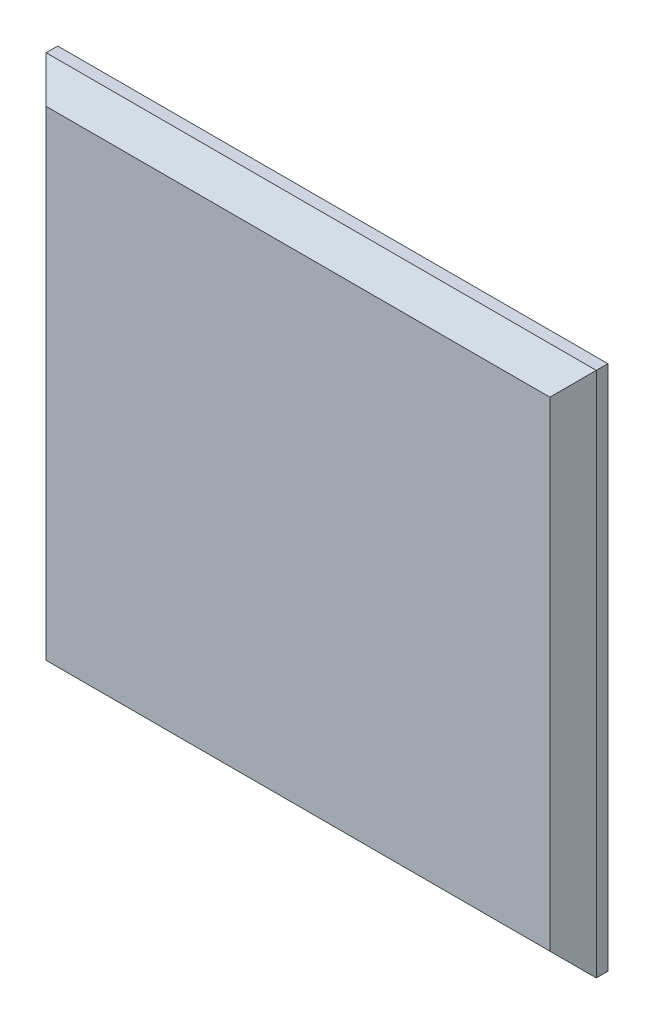
ISO-10303-21;
HEADER;
FILE_DESCRIPTION(('STEP AP214'),'2;1');
FILE_NAME('part.step','',(''),(''),'','','');
FILE_SCHEMA(('AUTOMOTIVE_DESIGN { 1 0 10303 214 1 1 1 1 }'));
ENDSEC;
DATA;
#1=APPLICATION_CONTEXT('core data for automotive mechanical design processes');
#2=APPLICATION_PROTOCOL_DEFINITION('international standard','automotive_design',2000,#1);
#3=PRODUCT_CONTEXT('',#1,'mechanical');
#4=PRODUCT('Part','Part','',(#3));
#5=PRODUCT_RELATED_PRODUCT_CATEGORY('part','',(#4));
#6=PRODUCT_DEFINITION_FORMATION('','',#4);
#7=PRODUCT_DEFINITION_CONTEXT('part definition',#1,'design');
#8=PRODUCT_DEFINITION('design','',#6,#7);
#9=PRODUCT_DEFINITION_SHAPE('','',#8);
#10=(LENGTH_UNIT() NAMED_UNIT(*) SI_UNIT(.MILLI.,.METRE.));
#11=(NAMED_UNIT(*) PLANE_ANGLE_UNIT() SI_UNIT($,.RADIAN.));
#12=(NAMED_UNIT(*) SI_UNIT($,.STERADIAN.) SOLID_ANGLE_UNIT());
#13=UNCERTAINTY_MEASURE_WITH_UNIT(LENGTH_MEASURE(1.E-05),#10,'distance_accuracy_value','');
#14=(GEOMETRIC_REPRESENTATION_CONTEXT(3) GLOBAL_UNCERTAINTY_ASSIGNED_CONTEXT((#13)) GLOBAL_UNIT_ASSIGNED_CONTEXT((#10,
#11,#12)) REPRESENTATION_CONTEXT('',''));
#15=CARTESIAN_POINT('',(0.,0.,0.));
#16=DIRECTION('',(0.,0.,1.));
#17=DIRECTION('',(1.,0.,0.));
#18=AXIS2_PLACEMENT_3D('',#15,#16,#17);
#19=CARTESIAN_POINT('',(0.,136.,6.));
#20=DIRECTION('',(0.,-1.,0.));
#21=DIRECTION('',(1.,0.,0.));
#22=AXIS2_PLACEMENT_3D('',#19,#20,#21);
#23=PLANE('',#22);
#24=DIRECTION('',(0.,0.,-1.));
#25=VECTOR('',#24,1.);
#26=CARTESIAN_POINT('',(-142.200000000008,136.,6.));
#27=LINE('',#26,#25);
#28=CARTESIAN_POINT('',(-142.200000000008,136.,2.99999999999999));
#29=VERTEX_POINT('',#28);
#30=CARTESIAN_POINT('',(-142.200000000008,136.,0.));
#31=VERTEX_POINT('',#30);
#32=EDGE_CURVE('E283',#29,#31,#27,.T.);
#33=ORIENTED_EDGE('',*,*,#32,.F.);
#34=DIRECTION('',(1.,0.,0.));
#35=VECTOR('',#34,1.);
#36=CARTESIAN_POINT('',(0.,136.,3.));
#37=LINE('',#36,#35);
#38=CARTESIAN_POINT('',(0.,136.,2.99999999999999));
#39=VERTEX_POINT('',#38);
#40=EDGE_CURVE('E318',#29,#39,#37,.T.);
#41=ORIENTED_EDGE('',*,*,#40,.T.);
#42=DIRECTION('',(0.,0.,-1.));
#43=VECTOR('',#42,1.);
#44=CARTESIAN_POINT('',(0.,136.,6.));
#45=LINE('',#44,#43);
#46=CARTESIAN_POINT('',(0.,136.,0.));
#47=VERTEX_POINT('',#46);
#48=EDGE_CURVE('E208',#39,#47,#45,.T.);
#49=ORIENTED_EDGE('',*,*,#48,.T.);
#50=DIRECTION('',(-1.,0.,0.));
#51=VECTOR('',#50,1.);
#52=CARTESIAN_POINT('',(0.,136.,0.));
#53=LINE('',#52,#51);
#54=EDGE_CURVE('E266',#47,#31,#53,.T.);
#55=ORIENTED_EDGE('',*,*,#54,.T.);
#56=EDGE_LOOP('',(#33,#41,#49,#55));
#57=FACE_BOUND('',#56,.T.);
#58=ADVANCED_FACE('F35',(#57),#23,.F.);
#59=CARTESIAN_POINT('',(-142.200000000008,0.,6.));
#60=DIRECTION('',(1.,0.,0.));
#61=DIRECTION('',(0.,0.,-1.));
#62=AXIS2_PLACEMENT_3D('',#59,#60,#61);
#63=PLANE('',#62);
#64=DIRECTION('',(0.,0.,-1.));
#65=VECTOR('',#64,1.);
#66=CARTESIAN_POINT('',(-142.200000000008,0.,6.));
#67=LINE('',#66,#65);
#68=CARTESIAN_POINT('',(-142.200000000008,0.,2.99999999999999));
#69=VERTEX_POINT('',#68);
#70=CARTESIAN_POINT('',(-142.200000000008,0.,0.));
#71=VERTEX_POINT('',#70);
#72=EDGE_CURVE('E281',#69,#71,#67,.T.);
#73=ORIENTED_EDGE('',*,*,#72,.F.);
#74=DIRECTION('',(0.,1.,0.));
#75=VECTOR('',#74,1.);
#76=CARTESIAN_POINT('',(-142.200000000008,136.,2.99999999999999));
#77=LINE('',#76,#75);
#78=EDGE_CURVE('E325',#69,#29,#77,.T.);
#79=ORIENTED_EDGE('',*,*,#78,.T.);
#80=ORIENTED_EDGE('',*,*,#32,.T.);
#81=DIRECTION('',(0.,-1.,0.));
#82=VECTOR('',#81,1.);
#83=CARTESIAN_POINT('',(-142.200000000008,0.,0.));
#84=LINE('',#83,#82);
#85=EDGE_CURVE('E269',#31,#71,#84,.T.);
#86=ORIENTED_EDGE('',*,*,#85,.T.);
#87=EDGE_LOOP('',(#73,#79,#80,#86));
#88=FACE_BOUND('',#87,.T.);
#89=ADVANCED_FACE('F441',(#88),#63,.F.);
#90=CARTESIAN_POINT('',(0.,0.,6.));
#91=DIRECTION('',(0.,1.,0.));
#92=DIRECTION('',(-1.,0.,0.));
#93=AXIS2_PLACEMENT_3D('',#90,#91,#92);
#94=PLANE('',#93);
#95=DIRECTION('',(0.,0.,-1.));
#96=VECTOR('',#95,1.);
#97=CARTESIAN_POINT('',(0.,0.,6.));
#98=LINE('',#97,#96);
#99=CARTESIAN_POINT('',(0.,0.,3.));
#100=VERTEX_POINT('',#99);
#101=CARTESIAN_POINT('',(0.,0.,0.));
#102=VERTEX_POINT('',#101);
#103=EDGE_CURVE('E279',#100,#102,#98,.T.);
#104=ORIENTED_EDGE('',*,*,#103,.F.);
#105=DIRECTION('',(-1.,0.,0.));
#106=VECTOR('',#105,1.);
#107=CARTESIAN_POINT('',(-142.200000000008,0.,3.));
#108=LINE('',#107,#106);
#109=EDGE_CURVE('E323',#100,#69,#108,.T.);
#110=ORIENTED_EDGE('',*,*,#109,.T.);
#111=ORIENTED_EDGE('',*,*,#72,.T.);
#112=DIRECTION('',(1.,0.,0.));
#113=VECTOR('',#112,1.);
#114=CARTESIAN_POINT('',(0.,0.,0.));
#115=LINE('',#114,#113);
#116=EDGE_CURVE('E272',#71,#102,#115,.T.);
#117=ORIENTED_EDGE('',*,*,#116,.T.);
#118=EDGE_LOOP('',(#104,#110,#111,#117));
#119=FACE_BOUND('',#118,.T.);
#120=ADVANCED_FACE('F447',(#119),#94,.F.);
#121=CARTESIAN_POINT('',(0.,126.5,6.));
#122=DIRECTION('',(0.,-1.,0.));
#123=DIRECTION('',(0.,0.,-1.));
#124=AXIS2_PLACEMENT_3D('',#121,#122,#123);
#125=PLANE('',#124);
#126=DIRECTION('',(0.,0.,-1.));
#127=VECTOR('',#126,1.);
#128=CARTESIAN_POINT('',(-135.700000000008,126.5,6.));
#129=LINE('',#128,#127);
#130=CARTESIAN_POINT('',(-135.700000000008,126.5,3.49999999999999));
#131=VERTEX_POINT('',#130);
#132=CARTESIAN_POINT('',(-135.700000000008,126.5,0.));
#133=VERTEX_POINT('',#132);
#134=EDGE_CURVE('E197',#131,#133,#129,.T.);
#135=ORIENTED_EDGE('',*,*,#134,.F.);
#136=DIRECTION('',(0.707106781186555,0.,0.70710678118654));
#137=VECTOR('',#136,1.);
#138=CARTESIAN_POINT('',(-66.6000000000025,126.5,72.6000000000038));
#139=LINE('',#138,#137);
#140=CARTESIAN_POINT('',(-137.200000000008,126.5,2.00000000000002));
#141=VERTEX_POINT('',#140);
#142=EDGE_CURVE('E362',#131,#141,#139,.F.);
#143=ORIENTED_EDGE('',*,*,#142,.T.);
#144=DIRECTION('',(0.,0.,-1.));
#145=VECTOR('',#144,1.);
#146=CARTESIAN_POINT('',(-137.200000000008,126.5,6.));
#147=LINE('',#146,#145);
#148=CARTESIAN_POINT('',(-137.200000000008,126.5,0.));
#149=VERTEX_POINT('',#148);
#150=EDGE_CURVE('E223',#141,#149,#147,.T.);
#151=ORIENTED_EDGE('',*,*,#150,.T.);
#152=DIRECTION('',(-1.,0.,0.));
#153=VECTOR('',#152,1.);
#154=CARTESIAN_POINT('',(0.,126.5,0.));
#155=LINE('',#154,#153);
#156=EDGE_CURVE('E216',#133,#149,#155,.T.);
#157=ORIENTED_EDGE('',*,*,#156,.F.);
#158=EDGE_LOOP('',(#135,#143,#151,#157));
#159=FACE_BOUND('',#158,.T.);
#160=ADVANCED_FACE('F221',(#159),#125,.T.);
#161=CARTESIAN_POINT('',(-135.700000000008,129.5,6.));
#162=DIRECTION('',(0.,0.,-1.));
#163=DIRECTION('',(-1.,0.,0.));
#164=AXIS2_PLACEMENT_3D('',#161,#162,#163);
#165=CYLINDRICAL_SURFACE('',#164,3.00000000000002);
#166=DIRECTION('',(0.,0.,-1.));
#167=VECTOR('',#166,1.);
#168=CARTESIAN_POINT('',(-132.700000000008,129.5,6.));
#169=LINE('',#168,#167);
#170=CARTESIAN_POINT('',(-132.700000000008,129.5,3.49999999999996));
#171=VERTEX_POINT('',#170);
#172=CARTESIAN_POINT('',(-132.700000000008,129.5,0.));
#173=VERTEX_POINT('',#172);
#174=EDGE_CURVE('E209',#171,#173,#169,.T.);
#175=ORIENTED_EDGE('',*,*,#174,.F.);
#176=CARTESIAN_POINT('',(-135.700000000008,129.5,3.49999999999996));
#177=DIRECTION('',(0.,0.707106781186552,0.707106781186542));
#178=DIRECTION('',(0.,0.707106781186543,-0.707106781186552));
#179=AXIS2_PLACEMENT_3D('',#176,#177,#178);
#180=ELLIPSE('',#179,4.24264068711935,3.00000000000002);
#181=CARTESIAN_POINT('',(-133.578679656448,127.37867965644,5.62132034355967));
#182=VERTEX_POINT('',#181);
#183=EDGE_CURVE('E339',#171,#182,#180,.F.);
#184=ORIENTED_EDGE('',*,*,#183,.T.);
#185=CARTESIAN_POINT('',(-135.700000000008,129.5,3.50000000000001));
#186=DIRECTION('',(0.70710678118654,0.,-0.707106781186555));
#187=DIRECTION('',(-0.707106781186555,0.,-0.70710678118654));
#188=AXIS2_PLACEMENT_3D('',#185,#186,#187);
#189=ELLIPSE('',#188,4.24264068711927,3.00000000000002);
#190=EDGE_CURVE('E204',#182,#131,#189,.T.);
#191=ORIENTED_EDGE('',*,*,#190,.T.);
#192=ORIENTED_EDGE('',*,*,#134,.T.);
#193=CARTESIAN_POINT('',(-135.700000000008,129.5,0.));
#194=DIRECTION('',(0.,0.,1.));
#195=DIRECTION('',(1.,0.,0.));
#196=AXIS2_PLACEMENT_3D('',#193,#194,#195);
#197=CIRCLE('',#196,3.00000000000002);
#198=EDGE_CURVE('E201',#133,#173,#197,.T.);
#199=ORIENTED_EDGE('',*,*,#198,.T.);
#200=EDGE_LOOP('',(#175,#184,#191,#192,#199));
#201=FACE_BOUND('',#200,.T.);
#202=ADVANCED_FACE('F200',(#201),#165,.T.);
#203=CARTESIAN_POINT('',(-132.700000000008,0.,6.));
#204=DIRECTION('',(-1.,0.,0.));
#205=DIRECTION('',(0.,0.,1.));
#206=AXIS2_PLACEMENT_3D('',#203,#204,#205);
#207=PLANE('',#206);
#208=DIRECTION('',(0.,0.,-1.));
#209=VECTOR('',#208,1.);
#210=CARTESIAN_POINT('',(-132.700000000008,131.,6.));
#211=LINE('',#210,#209);
#212=CARTESIAN_POINT('',(-132.700000000008,131.,1.99999999999993));
#213=VERTEX_POINT('',#212);
#214=CARTESIAN_POINT('',(-132.700000000008,131.,0.));
#215=VERTEX_POINT('',#214);
#216=EDGE_CURVE('E307',#213,#215,#211,.T.);
#217=ORIENTED_EDGE('',*,*,#216,.F.);
#218=DIRECTION('',(0.,-0.707106781186543,0.707106781186552));
#219=VECTOR('',#218,1.);
#220=CARTESIAN_POINT('',(-132.700000000008,131.,1.99999999999993));
#221=LINE('',#220,#219);
#222=EDGE_CURVE('E336',#213,#171,#221,.T.);
#223=ORIENTED_EDGE('',*,*,#222,.T.);
#224=ORIENTED_EDGE('',*,*,#174,.T.);
#225=DIRECTION('',(0.,1.,0.));
#226=VECTOR('',#225,1.);
#227=CARTESIAN_POINT('',(-132.700000000008,0.,0.));
#228=LINE('',#227,#226);
#229=EDGE_CURVE('E219',#173,#215,#228,.T.);
#230=ORIENTED_EDGE('',*,*,#229,.T.);
#231=EDGE_LOOP('',(#217,#223,#224,#230));
#232=FACE_BOUND('',#231,.T.);
#233=ADVANCED_FACE('F744',(#232),#207,.F.);
#234=CARTESIAN_POINT('',(0.,131.,6.));
#235=DIRECTION('',(0.,-1.,0.));
#236=DIRECTION('',(1.,0.,0.));
#237=AXIS2_PLACEMENT_3D('',#234,#235,#236);
#238=PLANE('',#237);
#239=DIRECTION('',(0.,0.,-1.));
#240=VECTOR('',#239,1.);
#241=CARTESIAN_POINT('',(-7.9999999999982,131.,6.));
#242=LINE('',#241,#240);
#243=CARTESIAN_POINT('',(-7.9999999999982,131.,1.99999999999994));
#244=VERTEX_POINT('',#243);
#245=CARTESIAN_POINT('',(-7.9999999999982,131.,0.));
#246=VERTEX_POINT('',#245);
#247=EDGE_CURVE('E305',#244,#246,#242,.T.);
#248=ORIENTED_EDGE('',*,*,#247,.F.);
#249=DIRECTION('',(-1.,0.,0.));
#250=VECTOR('',#249,1.);
#251=CARTESIAN_POINT('',(0.,131.,1.99999999999994));
#252=LINE('',#251,#250);
#253=EDGE_CURVE('E327',#244,#213,#252,.T.);
#254=ORIENTED_EDGE('',*,*,#253,.T.);
#255=ORIENTED_EDGE('',*,*,#216,.T.);
#256=DIRECTION('',(-1.,0.,0.));
#257=VECTOR('',#256,1.);
#258=CARTESIAN_POINT('',(0.,131.,0.));
#259=LINE('',#258,#257);
#260=EDGE_CURVE('E235',#246,#215,#259,.T.);
#261=ORIENTED_EDGE('',*,*,#260,.F.);
#262=EDGE_LOOP('',(#248,#254,#255,#261));
#263=FACE_BOUND('',#262,.T.);
#264=ADVANCED_FACE('F751',(#263),#238,.T.);
#265=CARTESIAN_POINT('',(-7.9999999999982,0.,6.));
#266=DIRECTION('',(-1.,0.,0.));
#267=DIRECTION('',(0.,0.,1.));
#268=AXIS2_PLACEMENT_3D('',#265,#266,#267);
#269=PLANE('',#268);
#270=DIRECTION('',(0.,0.,-1.));
#271=VECTOR('',#270,1.);
#272=CARTESIAN_POINT('',(-7.9999999999982,129.5,6.));
#273=LINE('',#272,#271);
#274=CARTESIAN_POINT('',(-7.9999999999982,129.5,3.49999999999997));
#275=VERTEX_POINT('',#274);
#276=CARTESIAN_POINT('',(-7.9999999999982,129.5,0.));
#277=VERTEX_POINT('',#276);
#278=EDGE_CURVE('E303',#275,#277,#273,.T.);
#279=ORIENTED_EDGE('',*,*,#278,.F.);
#280=DIRECTION('',(0.,0.707106781186543,-0.707106781186552));
#281=VECTOR('',#280,1.);
#282=CARTESIAN_POINT('',(-7.9999999999982,63.5000000000009,69.5));
#283=LINE('',#282,#281);
#284=EDGE_CURVE('E354',#275,#244,#283,.T.);
#285=ORIENTED_EDGE('',*,*,#284,.T.);
#286=ORIENTED_EDGE('',*,*,#247,.T.);
#287=DIRECTION('',(0.,1.,0.));
#288=VECTOR('',#287,1.);
#289=CARTESIAN_POINT('',(-7.9999999999982,0.,0.));
#290=LINE('',#289,#288);
#291=EDGE_CURVE('E237',#277,#246,#290,.T.);
#292=ORIENTED_EDGE('',*,*,#291,.F.);
#293=EDGE_LOOP('',(#279,#285,#286,#292));
#294=FACE_BOUND('',#293,.T.);
#295=ADVANCED_FACE('F759',(#294),#269,.T.);
#296=CARTESIAN_POINT('',(-4.9999999999982,129.5,6.));
#297=DIRECTION('',(0.,0.,-1.));
#298=DIRECTION('',(-1.,0.,0.));
#299=AXIS2_PLACEMENT_3D('',#296,#297,#298);
#300=CYLINDRICAL_SURFACE('',#299,3.);
#301=CARTESIAN_POINT('',(-4.9999999999982,129.5,1.99999999999994));
#302=DIRECTION('',(0.707106781186552,0.,0.707106781186542));
#303=DIRECTION('',(0.707106781186543,0.,-0.707106781186552));
#304=AXIS2_PLACEMENT_3D('',#301,#302,#303);
#305=ELLIPSE('',#304,4.24264068711932,3.);
#306=CARTESIAN_POINT('',(-4.9999999999982,126.5,1.99999999999994));
#307=VERTEX_POINT('',#306);
#308=CARTESIAN_POINT('',(-7.73431348329664,128.265686516702,4.73431348329842));
#309=VERTEX_POINT('',#308);
#310=EDGE_CURVE('E350',#307,#309,#305,.F.);
#311=ORIENTED_EDGE('',*,*,#310,.T.);
#312=CARTESIAN_POINT('',(-4.9999999999982,129.5,3.49999999999996));
#313=DIRECTION('',(0.,0.707106781186552,0.707106781186542));
#314=DIRECTION('',(0.,0.707106781186543,-0.707106781186552));
#315=AXIS2_PLACEMENT_3D('',#312,#313,#314);
#316=ELLIPSE('',#315,4.24264068711932,3.);
#317=EDGE_CURVE('E352',#309,#275,#316,.F.);
#318=ORIENTED_EDGE('',*,*,#317,.T.);
#319=ORIENTED_EDGE('',*,*,#278,.T.);
#320=CARTESIAN_POINT('',(-4.9999999999982,129.5,0.));
#321=DIRECTION('',(0.,0.,1.));
#322=DIRECTION('',(1.,0.,0.));
#323=AXIS2_PLACEMENT_3D('',#320,#321,#322);
#324=CIRCLE('',#323,3.);
#325=CARTESIAN_POINT('',(-4.9999999999982,126.5,0.));
#326=VERTEX_POINT('',#325);
#327=EDGE_CURVE('E240',#277,#326,#324,.T.);
#328=ORIENTED_EDGE('',*,*,#327,.T.);
#329=DIRECTION('',(0.,0.,-1.));
#330=VECTOR('',#329,1.);
#331=CARTESIAN_POINT('',(-4.9999999999982,126.5,6.));
#332=LINE('',#331,#330);
#333=EDGE_CURVE('E301',#307,#326,#332,.T.);
#334=ORIENTED_EDGE('',*,*,#333,.F.);
#335=EDGE_LOOP('',(#311,#318,#319,#328,#334));
#336=FACE_BOUND('',#335,.T.);
#337=ADVANCED_FACE('F767',(#336),#300,.T.);
#338=CARTESIAN_POINT('',(-4.9999999999982,0.,6.));
#339=DIRECTION('',(-1.,0.,0.));
#340=DIRECTION('',(0.,0.,1.));
#341=AXIS2_PLACEMENT_3D('',#338,#339,#340);
#342=PLANE('',#341);
#343=DIRECTION('',(0.,0.,-1.));
#344=VECTOR('',#343,1.);
#345=CARTESIAN_POINT('',(-4.9999999999982,9.5,6.));
#346=LINE('',#345,#344);
#347=CARTESIAN_POINT('',(-4.9999999999982,9.5,1.99999999999994));
#348=VERTEX_POINT('',#347);
#349=CARTESIAN_POINT('',(-4.9999999999982,9.5,0.));
#350=VERTEX_POINT('',#349);
#351=EDGE_CURVE('E299',#348,#350,#346,.T.);
#352=ORIENTED_EDGE('',*,*,#351,.F.);
#353=DIRECTION('',(0.,1.,0.));
#354=VECTOR('',#353,1.);
#355=CARTESIAN_POINT('',(-4.9999999999982,0.,1.99999999999994));
#356=LINE('',#355,#354);
#357=EDGE_CURVE('E356',#348,#307,#356,.T.);
#358=ORIENTED_EDGE('',*,*,#357,.T.);
#359=ORIENTED_EDGE('',*,*,#333,.T.);
#360=DIRECTION('',(0.,1.,0.));
#361=VECTOR('',#360,1.);
#362=CARTESIAN_POINT('',(-4.9999999999982,0.,0.));
#363=LINE('',#362,#361);
#364=EDGE_CURVE('E243',#350,#326,#363,.T.);
#365=ORIENTED_EDGE('',*,*,#364,.F.);
#366=EDGE_LOOP('',(#352,#358,#359,#365));
#367=FACE_BOUND('',#366,.T.);
#368=ADVANCED_FACE('F775',(#367),#342,.T.);
#369=CARTESIAN_POINT('',(-4.9999999999982,6.5,6.));
#370=DIRECTION('',(0.,0.,-1.));
#371=DIRECTION('',(-1.,0.,0.));
#372=AXIS2_PLACEMENT_3D('',#369,#370,#371);
#373=CYLINDRICAL_SURFACE('',#372,3.);
#374=CARTESIAN_POINT('',(-4.9999999999982,6.5,3.49999999999996));
#375=DIRECTION('',(0.,-0.707106781186552,0.707106781186543));
#376=DIRECTION('',(0.,-0.707106781186543,-0.707106781186552));
#377=AXIS2_PLACEMENT_3D('',#374,#375,#376);
#378=ELLIPSE('',#377,4.24264068711931,3.);
#379=CARTESIAN_POINT('',(-7.9999999999982,6.5,3.49999999999996));
#380=VERTEX_POINT('',#379);
#381=CARTESIAN_POINT('',(-7.73431348329664,7.73431348329844,4.73431348329842));
#382=VERTEX_POINT('',#381);
#383=EDGE_CURVE('E358',#380,#382,#378,.F.);
#384=ORIENTED_EDGE('',*,*,#383,.T.);
#385=CARTESIAN_POINT('',(-4.9999999999982,6.5,1.99999999999994));
#386=DIRECTION('',(0.707106781186552,0.,0.707106781186542));
#387=DIRECTION('',(0.707106781186543,0.,-0.707106781186552));
#388=AXIS2_PLACEMENT_3D('',#385,#386,#387);
#389=ELLIPSE('',#388,4.24264068711931,3.);
#390=EDGE_CURVE('E360',#382,#348,#389,.F.);
#391=ORIENTED_EDGE('',*,*,#390,.T.);
#392=ORIENTED_EDGE('',*,*,#351,.T.);
#393=CARTESIAN_POINT('',(-4.9999999999982,6.5,0.));
#394=DIRECTION('',(0.,0.,1.));
#395=DIRECTION('',(1.,0.,0.));
#396=AXIS2_PLACEMENT_3D('',#393,#394,#395);
#397=CIRCLE('',#396,3.);
#398=CARTESIAN_POINT('',(-7.9999999999982,6.5,0.));
#399=VERTEX_POINT('',#398);
#400=EDGE_CURVE('E246',#350,#399,#397,.T.);
#401=ORIENTED_EDGE('',*,*,#400,.T.);
#402=DIRECTION('',(0.,0.,-1.));
#403=VECTOR('',#402,1.);
#404=CARTESIAN_POINT('',(-7.9999999999982,6.5,6.));
#405=LINE('',#404,#403);
#406=EDGE_CURVE('E297',#380,#399,#405,.T.);
#407=ORIENTED_EDGE('',*,*,#406,.F.);
#408=EDGE_LOOP('',(#384,#391,#392,#401,#407));
#409=FACE_BOUND('',#408,.T.);
#410=ADVANCED_FACE('F425',(#409),#373,.T.);
#411=CARTESIAN_POINT('',(-7.9999999999982,0.,6.));
#412=DIRECTION('',(1.,0.,0.));
#413=DIRECTION('',(0.,0.,-1.));
#414=AXIS2_PLACEMENT_3D('',#411,#412,#413);
#415=PLANE('',#414);
#416=DIRECTION('',(0.,0.,-1.));
#417=VECTOR('',#416,1.);
#418=CARTESIAN_POINT('',(-7.9999999999982,5.,6.));
#419=LINE('',#418,#417);
#420=CARTESIAN_POINT('',(-7.9999999999982,5.,1.99999999999994));
#421=VERTEX_POINT('',#420);
#422=CARTESIAN_POINT('',(-7.9999999999982,5.,0.));
#423=VERTEX_POINT('',#422);
#424=EDGE_CURVE('E295',#421,#423,#419,.T.);
#425=ORIENTED_EDGE('',*,*,#424,.F.);
#426=DIRECTION('',(0.,0.707106781186543,0.707106781186552));
#427=VECTOR('',#426,1.);
#428=CARTESIAN_POINT('',(-7.9999999999982,5.,1.99999999999994));
#429=LINE('',#428,#427);
#430=EDGE_CURVE('E44',#421,#380,#429,.T.);
#431=ORIENTED_EDGE('',*,*,#430,.T.);
#432=ORIENTED_EDGE('',*,*,#406,.T.);
#433=DIRECTION('',(0.,-1.,0.));
#434=VECTOR('',#433,1.);
#435=CARTESIAN_POINT('',(-7.9999999999982,0.,0.));
#436=LINE('',#435,#434);
#437=EDGE_CURVE('E249',#399,#423,#436,.T.);
#438=ORIENTED_EDGE('',*,*,#437,.T.);
#439=EDGE_LOOP('',(#425,#431,#432,#438));
#440=FACE_BOUND('',#439,.T.);
#441=ADVANCED_FACE('F423',(#440),#415,.F.);
#442=CARTESIAN_POINT('',(0.,5.,6.));
#443=DIRECTION('',(0.,1.,0.));
#444=DIRECTION('',(0.,0.,1.));
#445=AXIS2_PLACEMENT_3D('',#442,#443,#444);
#446=PLANE('',#445);
#447=DIRECTION('',(0.,0.,-1.));
#448=VECTOR('',#447,1.);
#449=CARTESIAN_POINT('',(-132.700000000008,5.,6.));
#450=LINE('',#449,#448);
#451=CARTESIAN_POINT('',(-132.700000000008,5.,1.99999999999994));
#452=VERTEX_POINT('',#451);
#453=CARTESIAN_POINT('',(-132.700000000008,5.,0.));
#454=VERTEX_POINT('',#453);
#455=EDGE_CURVE('E293',#452,#454,#450,.T.);
#456=ORIENTED_EDGE('',*,*,#455,.F.);
#457=DIRECTION('',(1.,0.,0.));
#458=VECTOR('',#457,1.);
#459=CARTESIAN_POINT('',(0.,5.,1.99999999999994));
#460=LINE('',#459,#458);
#461=EDGE_CURVE('E52',#452,#421,#460,.T.);
#462=ORIENTED_EDGE('',*,*,#461,.T.);
#463=ORIENTED_EDGE('',*,*,#424,.T.);
#464=DIRECTION('',(1.,0.,0.));
#465=VECTOR('',#464,1.);
#466=CARTESIAN_POINT('',(0.,5.,0.));
#467=LINE('',#466,#465);
#468=EDGE_CURVE('E252',#454,#423,#467,.T.);
#469=ORIENTED_EDGE('',*,*,#468,.F.);
#470=EDGE_LOOP('',(#456,#462,#463,#469));
#471=FACE_BOUND('',#470,.T.);
#472=ADVANCED_FACE('F431',(#471),#446,.T.);
#473=CARTESIAN_POINT('',(-132.700000000008,0.,6.));
#474=DIRECTION('',(1.,0.,0.));
#475=DIRECTION('',(0.,0.,-1.));
#476=AXIS2_PLACEMENT_3D('',#473,#474,#475);
#477=PLANE('',#476);
#478=DIRECTION('',(0.,0.,-1.));
#479=VECTOR('',#478,1.);
#480=CARTESIAN_POINT('',(-132.700000000008,6.5,6.));
#481=LINE('',#480,#479);
#482=CARTESIAN_POINT('',(-132.700000000008,6.5,3.49999999999996));
#483=VERTEX_POINT('',#482);
#484=CARTESIAN_POINT('',(-132.700000000008,6.5,0.));
#485=VERTEX_POINT('',#484);
#486=EDGE_CURVE('E291',#483,#485,#481,.T.);
#487=ORIENTED_EDGE('',*,*,#486,.F.);
#488=DIRECTION('',(0.,-0.707106781186543,-0.707106781186552));
#489=VECTOR('',#488,1.);
#490=CARTESIAN_POINT('',(-132.700000000008,4.50000000000006,1.5));
#491=LINE('',#490,#489);
#492=EDGE_CURVE('E11',#483,#452,#491,.T.);
#493=ORIENTED_EDGE('',*,*,#492,.T.);
#494=ORIENTED_EDGE('',*,*,#455,.T.);
#495=DIRECTION('',(0.,-1.,0.));
#496=VECTOR('',#495,1.);
#497=CARTESIAN_POINT('',(-132.700000000008,0.,0.));
#498=LINE('',#497,#496);
#499=EDGE_CURVE('E255',#485,#454,#498,.T.);
#500=ORIENTED_EDGE('',*,*,#499,.F.);
#501=EDGE_LOOP('',(#487,#493,#494,#500));
#502=FACE_BOUND('',#501,.T.);
#503=ADVANCED_FACE('F420',(#502),#477,.T.);
#504=CARTESIAN_POINT('',(-135.700000000008,6.5,6.));
#505=DIRECTION('',(0.,0.,-1.));
#506=DIRECTION('',(-1.,0.,0.));
#507=AXIS2_PLACEMENT_3D('',#504,#505,#506);
#508=CYLINDRICAL_SURFACE('',#507,2.99999999999999);
#509=DIRECTION('',(0.,0.,-1.));
#510=VECTOR('',#509,1.);
#511=CARTESIAN_POINT('',(-135.700000000008,9.5,6.));
#512=LINE('',#511,#510);
#513=CARTESIAN_POINT('',(-135.700000000008,9.5,3.50000000000056));
#514=VERTEX_POINT('',#513);
#515=CARTESIAN_POINT('',(-135.700000000008,9.5,0.));
#516=VERTEX_POINT('',#515);
#517=EDGE_CURVE('E289',#514,#516,#512,.T.);
#518=ORIENTED_EDGE('',*,*,#517,.F.);
#519=CARTESIAN_POINT('',(-135.700000000008,6.5,3.50000000000057));
#520=DIRECTION('',(0.70710678118654,0.,-0.707106781186555));
#521=DIRECTION('',(-0.707106781186555,0.,-0.70710678118654));
#522=AXIS2_PLACEMENT_3D('',#519,#520,#521);
#523=ELLIPSE('',#522,4.24264068711923,2.99999999999999);
#524=CARTESIAN_POINT('',(-133.578679656448,8.62132034355989,5.62132034355988));
#525=VERTEX_POINT('',#524);
#526=EDGE_CURVE('E370',#514,#525,#523,.T.);
#527=ORIENTED_EDGE('',*,*,#526,.T.);
#528=CARTESIAN_POINT('',(-135.700000000008,6.5,3.49999999999996));
#529=DIRECTION('',(0.,-0.707106781186552,0.707106781186543));
#530=DIRECTION('',(0.,-0.707106781186543,-0.707106781186552));
#531=AXIS2_PLACEMENT_3D('',#528,#529,#530);
#532=ELLIPSE('',#531,4.24264068711931,2.99999999999999);
#533=EDGE_CURVE('E368',#525,#483,#532,.F.);
#534=ORIENTED_EDGE('',*,*,#533,.T.);
#535=ORIENTED_EDGE('',*,*,#486,.T.);
#536=CARTESIAN_POINT('',(-135.700000000008,6.5,0.));
#537=DIRECTION('',(0.,0.,1.));
#538=DIRECTION('',(1.,0.,0.));
#539=AXIS2_PLACEMENT_3D('',#536,#537,#538);
#540=CIRCLE('',#539,2.99999999999999);
#541=EDGE_CURVE('E258',#485,#516,#540,.T.);
#542=ORIENTED_EDGE('',*,*,#541,.T.);
#543=EDGE_LOOP('',(#518,#527,#534,#535,#542));
#544=FACE_BOUND('',#543,.T.);
#545=ADVANCED_FACE('F419',(#544),#508,.T.);
#546=CARTESIAN_POINT('',(0.,9.5,6.));
#547=DIRECTION('',(0.,-1.,0.));
#548=DIRECTION('',(0.,0.,-1.));
#549=AXIS2_PLACEMENT_3D('',#546,#547,#548);
#550=PLANE('',#549);
#551=DIRECTION('',(0.,0.,-1.));
#552=VECTOR('',#551,1.);
#553=CARTESIAN_POINT('',(-137.200000000008,9.5,6.));
#554=LINE('',#553,#552);
#555=CARTESIAN_POINT('',(-137.200000000008,9.5,2.00000000000031));
#556=VERTEX_POINT('',#555);
#557=CARTESIAN_POINT('',(-137.200000000008,9.5,0.));
#558=VERTEX_POINT('',#557);
#559=EDGE_CURVE('E287',#556,#558,#554,.T.);
#560=ORIENTED_EDGE('',*,*,#559,.F.);
#561=DIRECTION('',(-0.707106781186555,0.,-0.70710678118654));
#562=VECTOR('',#561,1.);
#563=CARTESIAN_POINT('',(-133.200000000008,9.5,5.99999999999998));
#564=LINE('',#563,#562);
#565=EDGE_CURVE('E366',#556,#514,#564,.F.);
#566=ORIENTED_EDGE('',*,*,#565,.T.);
#567=ORIENTED_EDGE('',*,*,#517,.T.);
#568=DIRECTION('',(-1.,0.,0.));
#569=VECTOR('',#568,1.);
#570=CARTESIAN_POINT('',(0.,9.5,0.));
#571=LINE('',#570,#569);
#572=EDGE_CURVE('E261',#516,#558,#571,.T.);
#573=ORIENTED_EDGE('',*,*,#572,.T.);
#574=EDGE_LOOP('',(#560,#566,#567,#573));
#575=FACE_BOUND('',#574,.T.);
#576=ADVANCED_FACE('F416',(#575),#550,.F.);
#577=CARTESIAN_POINT('',(-137.200000000008,6.34677495744086E-13,6.));
#578=DIRECTION('',(-1.,0.,0.));
#579=DIRECTION('',(0.,-1.,0.));
#580=AXIS2_PLACEMENT_3D('',#577,#578,#579);
#581=PLANE('',#580);
#582=ORIENTED_EDGE('',*,*,#150,.F.);
#583=DIRECTION('',(0.,-1.,0.));
#584=VECTOR('',#583,1.);
#585=CARTESIAN_POINT('',(-137.200000000008,9.5,2.00000000000002));
#586=LINE('',#585,#584);
#587=EDGE_CURVE('E364',#141,#556,#586,.T.);
#588=ORIENTED_EDGE('',*,*,#587,.T.);
#589=ORIENTED_EDGE('',*,*,#559,.T.);
#590=DIRECTION('',(0.,1.,0.));
#591=VECTOR('',#590,1.);
#592=CARTESIAN_POINT('',(-137.200000000008,6.34677495744086E-13,0.));
#593=LINE('',#592,#591);
#594=EDGE_CURVE('E264',#558,#149,#593,.T.);
#595=ORIENTED_EDGE('',*,*,#594,.T.);
#596=EDGE_LOOP('',(#582,#588,#589,#595));
#597=FACE_BOUND('',#596,.T.);
#598=ADVANCED_FACE('F410',(#597),#581,.F.);
#599=CARTESIAN_POINT('',(0.,0.,6.));
#600=DIRECTION('',(-1.,0.,0.));
#601=DIRECTION('',(0.,-1.,0.));
#602=AXIS2_PLACEMENT_3D('',#599,#600,#601);
#603=PLANE('',#602);
#604=ORIENTED_EDGE('',*,*,#48,.F.);
#605=DIRECTION('',(0.,-1.,0.));
#606=VECTOR('',#605,1.);
#607=CARTESIAN_POINT('',(0.,0.,2.99999999999999));
#608=LINE('',#607,#606);
#609=EDGE_CURVE('E321',#39,#100,#608,.T.);
#610=ORIENTED_EDGE('',*,*,#609,.T.);
#611=ORIENTED_EDGE('',*,*,#103,.T.);
#612=DIRECTION('',(0.,1.,0.));
#613=VECTOR('',#612,1.);
#614=CARTESIAN_POINT('',(0.,0.,0.));
#615=LINE('',#614,#613);
#616=EDGE_CURVE('E275',#102,#47,#615,.T.);
#617=ORIENTED_EDGE('',*,*,#616,.T.);
#618=EDGE_LOOP('',(#604,#610,#611,#617));
#619=FACE_BOUND('',#618,.T.);
#620=ADVANCED_FACE('F455',(#619),#603,.F.);
#621=CARTESIAN_POINT('',(0.,0.,0.));
#622=DIRECTION('',(0.,0.,1.));
#623=DIRECTION('',(1.,0.,0.));
#624=AXIS2_PLACEMENT_3D('',#621,#622,#623);
#625=PLANE('',#624);
#626=CARTESIAN_POINT('',(-4.9999999999982,129.5,0.));
#627=DIRECTION('',(0.,0.,-1.));
#628=DIRECTION('',(-1.,0.,0.));
#629=AXIS2_PLACEMENT_3D('',#626,#627,#628);
#630=CIRCLE('',#629,1.55);
#631=CARTESIAN_POINT('',(-6.5499999999982,129.5,0.));
#632=VERTEX_POINT('',#631);
#633=EDGE_CURVE('E864',#632,#632,#630,.T.);
#634=ORIENTED_EDGE('',*,*,#633,.F.);
#635=EDGE_LOOP('',(#634));
#636=FACE_BOUND('',#635,.T.);
#637=CARTESIAN_POINT('',(-4.9999999999982,6.5,0.));
#638=DIRECTION('',(0.,0.,-1.));
#639=DIRECTION('',(-1.,0.,0.));
#640=AXIS2_PLACEMENT_3D('',#637,#638,#639);
#641=CIRCLE('',#640,1.55);
#642=CARTESIAN_POINT('',(-6.5499999999982,6.5,0.));
#643=VERTEX_POINT('',#642);
#644=EDGE_CURVE('E863',#643,#643,#641,.T.);
#645=ORIENTED_EDGE('',*,*,#644,.F.);
#646=EDGE_LOOP('',(#645));
#647=FACE_BOUND('',#646,.T.);
#648=CARTESIAN_POINT('',(-135.700000000008,6.5,0.));
#649=DIRECTION('',(0.,0.,-1.));
#650=DIRECTION('',(-1.,0.,0.));
#651=AXIS2_PLACEMENT_3D('',#648,#649,#650);
#652=CIRCLE('',#651,1.54999999999999);
#653=CARTESIAN_POINT('',(-137.250000000008,6.5,0.));
#654=VERTEX_POINT('',#653);
#655=EDGE_CURVE('E873',#654,#654,#652,.T.);
#656=ORIENTED_EDGE('',*,*,#655,.F.);
#657=EDGE_LOOP('',(#656));
#658=FACE_BOUND('',#657,.T.);
#659=CARTESIAN_POINT('',(-135.700000000008,129.5,0.));
#660=DIRECTION('',(0.,0.,-1.));
#661=DIRECTION('',(-1.,0.,0.));
#662=AXIS2_PLACEMENT_3D('',#659,#660,#661);
#663=CIRCLE('',#662,1.54999999999999);
#664=CARTESIAN_POINT('',(-137.250000000008,129.5,0.));
#665=VERTEX_POINT('',#664);
#666=EDGE_CURVE('E231',#665,#665,#663,.T.);
#667=ORIENTED_EDGE('',*,*,#666,.F.);
#668=EDGE_LOOP('',(#667));
#669=FACE_BOUND('',#668,.T.);
#670=ORIENTED_EDGE('',*,*,#156,.T.);
#671=ORIENTED_EDGE('',*,*,#594,.F.);
#672=ORIENTED_EDGE('',*,*,#572,.F.);
#673=ORIENTED_EDGE('',*,*,#541,.F.);
#674=ORIENTED_EDGE('',*,*,#499,.T.);
#675=ORIENTED_EDGE('',*,*,#468,.T.);
#676=ORIENTED_EDGE('',*,*,#437,.F.);
#677=ORIENTED_EDGE('',*,*,#400,.F.);
#678=ORIENTED_EDGE('',*,*,#364,.T.);
#679=ORIENTED_EDGE('',*,*,#327,.F.);
#680=ORIENTED_EDGE('',*,*,#291,.T.);
#681=ORIENTED_EDGE('',*,*,#260,.T.);
#682=ORIENTED_EDGE('',*,*,#229,.F.);
#683=ORIENTED_EDGE('',*,*,#198,.F.);
#684=EDGE_LOOP('',(#670,#671,#672,#673,#674,#675,#676,#677,#678,#679,#680,#681,#682,#683));
#685=FACE_BOUND('',#684,.T.);
#686=ORIENTED_EDGE('',*,*,#54,.F.);
#687=ORIENTED_EDGE('',*,*,#616,.F.);
#688=ORIENTED_EDGE('',*,*,#116,.F.);
#689=ORIENTED_EDGE('',*,*,#85,.F.);
#690=EDGE_LOOP('',(#686,#687,#688,#689));
#691=FACE_BOUND('',#690,.T.);
#692=ADVANCED_FACE('F213',(#636,#647,#658,#669,#685,#691),#625,.F.);
#693=CARTESIAN_POINT('',(0.,0.,9.));
#694=DIRECTION('',(0.,0.,1.));
#695=DIRECTION('',(1.,0.,0.));
#696=AXIS2_PLACEMENT_3D('',#693,#694,#695);
#697=PLANE('',#696);
#698=DIRECTION('',(0.,1.,0.));
#699=VECTOR('',#698,1.);
#700=CARTESIAN_POINT('',(-5.99999999999992,136.,9.));
#701=LINE('',#700,#699);
#702=CARTESIAN_POINT('',(-5.99999999999998,5.99999999999998,9.));
#703=VERTEX_POINT('',#702);
#704=CARTESIAN_POINT('',(-5.99999999999992,130.,9.));
#705=VERTEX_POINT('',#704);
#706=EDGE_CURVE('E313',#703,#705,#701,.T.);
#707=ORIENTED_EDGE('',*,*,#706,.T.);
#708=DIRECTION('',(-1.,0.,0.));
#709=VECTOR('',#708,1.);
#710=CARTESIAN_POINT('',(-142.200000000008,130.,9.));
#711=LINE('',#710,#709);
#712=CARTESIAN_POINT('',(-136.200000000008,130.,9.));
#713=VERTEX_POINT('',#712);
#714=EDGE_CURVE('E315',#705,#713,#711,.T.);
#715=ORIENTED_EDGE('',*,*,#714,.T.);
#716=DIRECTION('',(0.,-1.,0.));
#717=VECTOR('',#716,1.);
#718=CARTESIAN_POINT('',(-136.200000000008,0.,9.));
#719=LINE('',#718,#717);
#720=CARTESIAN_POINT('',(-136.200000000008,5.99999999999998,9.));
#721=VERTEX_POINT('',#720);
#722=EDGE_CURVE('E285',#713,#721,#719,.T.);
#723=ORIENTED_EDGE('',*,*,#722,.T.);
#724=DIRECTION('',(1.,0.,0.));
#725=VECTOR('',#724,1.);
#726=CARTESIAN_POINT('',(0.,5.99999999999998,9.));
#727=LINE('',#726,#725);
#728=EDGE_CURVE('E311',#721,#703,#727,.T.);
#729=ORIENTED_EDGE('',*,*,#728,.T.);
#730=EDGE_LOOP('',(#707,#715,#723,#729));
#731=FACE_BOUND('',#730,.T.);
#732=ADVANCED_FACE('F487',(#731),#697,.T.);
#733=CARTESIAN_POINT('',(0.,0.,6.));
#734=DIRECTION('',(0.,0.,1.));
#735=DIRECTION('',(1.,0.,0.));
#736=AXIS2_PLACEMENT_3D('',#733,#734,#735);
#737=PLANE('',#736);
#738=DIRECTION('',(0.,1.,0.));
#739=VECTOR('',#738,1.);
#740=CARTESIAN_POINT('',(-133.200000000008,126.5,6.));
#741=LINE('',#740,#739);
#742=CARTESIAN_POINT('',(-133.200000000008,9.00000000000001,6.));
#743=VERTEX_POINT('',#742);
#744=CARTESIAN_POINT('',(-133.200000000008,127.,6.));
#745=VERTEX_POINT('',#744);
#746=EDGE_CURVE('E343',#743,#745,#741,.T.);
#747=ORIENTED_EDGE('',*,*,#746,.T.);
#748=DIRECTION('',(1.,0.,0.));
#749=VECTOR('',#748,1.);
#750=CARTESIAN_POINT('',(0.,127.,6.));
#751=LINE('',#750,#749);
#752=CARTESIAN_POINT('',(-8.9999999999982,127.,6.));
#753=VERTEX_POINT('',#752);
#754=EDGE_CURVE('E347',#745,#753,#751,.T.);
#755=ORIENTED_EDGE('',*,*,#754,.T.);
#756=DIRECTION('',(0.,-1.,0.));
#757=VECTOR('',#756,1.);
#758=CARTESIAN_POINT('',(-8.9999999999982,0.,6.));
#759=LINE('',#758,#757);
#760=CARTESIAN_POINT('',(-8.9999999999982,9.00000000000001,6.));
#761=VERTEX_POINT('',#760);
#762=EDGE_CURVE('E345',#753,#761,#759,.T.);
#763=ORIENTED_EDGE('',*,*,#762,.T.);
#764=DIRECTION('',(-1.,0.,0.));
#765=VECTOR('',#764,1.);
#766=CARTESIAN_POINT('',(0.,9.00000000000001,6.));
#767=LINE('',#766,#765);
#768=EDGE_CURVE('E341',#761,#743,#767,.T.);
#769=ORIENTED_EDGE('',*,*,#768,.T.);
#770=EDGE_LOOP('',(#747,#755,#763,#769));
#771=FACE_BOUND('',#770,.T.);
#772=ADVANCED_FACE('F399',(#771),#737,.F.);
#773=CARTESIAN_POINT('',(0.,5.99999999999998,9.));
#774=DIRECTION('',(0.,-0.707106781186549,0.707106781186546));
#775=DIRECTION('',(-1.,0.,0.));
#776=AXIS2_PLACEMENT_3D('',#773,#774,#775);
#777=PLANE('',#776);
#778=DIRECTION('',(0.577350269189625,0.577350269189625,0.577350269189628));
#779=VECTOR('',#778,1.);
#780=CARTESIAN_POINT('',(-138.200000000008,3.99999999999999,7.));
#781=LINE('',#780,#779);
#782=EDGE_CURVE('E228',#69,#721,#781,.T.);
#783=ORIENTED_EDGE('',*,*,#782,.F.);
#784=ORIENTED_EDGE('',*,*,#109,.F.);
#785=DIRECTION('',(-0.577350269189625,0.577350269189625,0.577350269189628));
#786=VECTOR('',#785,1.);
#787=CARTESIAN_POINT('',(-3.99999999999999,3.99999999999999,7.00000000000001));
#788=LINE('',#787,#786);
#789=EDGE_CURVE('E225',#703,#100,#788,.F.);
#790=ORIENTED_EDGE('',*,*,#789,.F.);
#791=ORIENTED_EDGE('',*,*,#728,.F.);
#792=EDGE_LOOP('',(#783,#784,#790,#791));
#793=FACE_BOUND('',#792,.T.);
#794=ADVANCED_FACE('F503',(#793),#777,.T.);
#795=CARTESIAN_POINT('',(-5.99999999999998,0.,9.));
#796=DIRECTION('',(0.707106781186549,0.,0.707106781186546));
#797=DIRECTION('',(0.,-1.,0.));
#798=AXIS2_PLACEMENT_3D('',#795,#796,#797);
#799=PLANE('',#798);
#800=ORIENTED_EDGE('',*,*,#789,.T.);
#801=ORIENTED_EDGE('',*,*,#609,.F.);
#802=DIRECTION('',(-0.577350269189626,-0.577350269189623,0.577350269189628));
#803=VECTOR('',#802,1.);
#804=CARTESIAN_POINT('',(-49.3333333333331,86.6666666666671,52.3333333333334));
#805=LINE('',#804,#803);
#806=EDGE_CURVE('E330',#705,#39,#805,.F.);
#807=ORIENTED_EDGE('',*,*,#806,.F.);
#808=ORIENTED_EDGE('',*,*,#706,.F.);
#809=EDGE_LOOP('',(#800,#801,#807,#808));
#810=FACE_BOUND('',#809,.T.);
#811=ADVANCED_FACE('F510',(#810),#799,.T.);
#812=CARTESIAN_POINT('',(-136.200000000008,0.,9.));
#813=DIRECTION('',(-0.707106781186549,0.,0.707106781186546));
#814=DIRECTION('',(0.,1.,0.));
#815=AXIS2_PLACEMENT_3D('',#812,#813,#814);
#816=PLANE('',#815);
#817=ORIENTED_EDGE('',*,*,#782,.T.);
#818=ORIENTED_EDGE('',*,*,#722,.F.);
#819=DIRECTION('',(-0.577350269189626,0.577350269189623,-0.577350269189629));
#820=VECTOR('',#819,1.);
#821=CARTESIAN_POINT('',(-92.8666666666746,86.6666666666671,52.3333333333333));
#822=LINE('',#821,#820);
#823=EDGE_CURVE('E328',#29,#713,#822,.F.);
#824=ORIENTED_EDGE('',*,*,#823,.F.);
#825=ORIENTED_EDGE('',*,*,#78,.F.);
#826=EDGE_LOOP('',(#817,#818,#824,#825));
#827=FACE_BOUND('',#826,.T.);
#828=ADVANCED_FACE('F518',(#827),#816,.T.);
#829=CARTESIAN_POINT('',(0.,130.,9.));
#830=DIRECTION('',(0.,0.707106781186551,0.707106781186544));
#831=DIRECTION('',(1.,0.,0.));
#832=AXIS2_PLACEMENT_3D('',#829,#830,#831);
#833=PLANE('',#832);
#834=ORIENTED_EDGE('',*,*,#806,.T.);
#835=ORIENTED_EDGE('',*,*,#40,.F.);
#836=ORIENTED_EDGE('',*,*,#823,.T.);
#837=ORIENTED_EDGE('',*,*,#714,.F.);
#838=EDGE_LOOP('',(#834,#835,#836,#837));
#839=FACE_BOUND('',#838,.T.);
#840=ADVANCED_FACE('F526',(#839),#833,.T.);
#841=CARTESIAN_POINT('',(0.,5.,1.99999999999994));
#842=DIRECTION('',(0.,-0.707106781186552,0.707106781186543));
#843=DIRECTION('',(1.,0.,0.));
#844=AXIS2_PLACEMENT_3D('',#841,#842,#843);
#845=PLANE('',#844);
#846=DIRECTION('',(0.577350269189638,0.577350269189616,0.577350269189624));
#847=VECTOR('',#846,1.);
#848=CARTESIAN_POINT('',(-91.4666666666703,50.7333333333363,47.7333333333369));
#849=LINE('',#848,#847);
#850=EDGE_CURVE('E379',#743,#525,#849,.F.);
#851=ORIENTED_EDGE('',*,*,#850,.F.);
#852=ORIENTED_EDGE('',*,*,#768,.F.);
#853=DIRECTION('',(0.577350269189623,-0.577350269189623,-0.577350269189631));
#854=VECTOR('',#853,1.);
#855=CARTESIAN_POINT('',(-3.33333333333155,3.33333333333335,0.333333333333267));
#856=LINE('',#855,#854);
#857=EDGE_CURVE('E39',#382,#761,#856,.F.);
#858=ORIENTED_EDGE('',*,*,#857,.F.);
#859=ORIENTED_EDGE('',*,*,#383,.F.);
#860=ORIENTED_EDGE('',*,*,#430,.F.);
#861=ORIENTED_EDGE('',*,*,#461,.F.);
#862=ORIENTED_EDGE('',*,*,#492,.F.);
#863=ORIENTED_EDGE('',*,*,#533,.F.);
#864=EDGE_LOOP('',(#851,#852,#858,#859,#860,#861,#862,#863));
#865=FACE_BOUND('',#864,.T.);
#866=ADVANCED_FACE('F37',(#865),#845,.F.);
#867=CARTESIAN_POINT('',(-4.9999999999982,0.,1.99999999999994));
#868=DIRECTION('',(0.707106781186552,0.,0.707106781186542));
#869=DIRECTION('',(0.,1.,0.));
#870=AXIS2_PLACEMENT_3D('',#867,#868,#869);
#871=PLANE('',#870);
#872=ORIENTED_EDGE('',*,*,#857,.T.);
#873=ORIENTED_EDGE('',*,*,#762,.F.);
#874=DIRECTION('',(0.577350269189623,0.577350269189623,-0.577350269189631));
#875=VECTOR('',#874,1.);
#876=CARTESIAN_POINT('',(-3.33333333333216,132.666666666666,0.333333333333875));
#877=LINE('',#876,#875);
#878=EDGE_CURVE('E377',#309,#753,#877,.F.);
#879=ORIENTED_EDGE('',*,*,#878,.F.);
#880=ORIENTED_EDGE('',*,*,#310,.F.);
#881=ORIENTED_EDGE('',*,*,#357,.F.);
#882=ORIENTED_EDGE('',*,*,#390,.F.);
#883=EDGE_LOOP('',(#872,#873,#879,#880,#881,#882));
#884=FACE_BOUND('',#883,.T.);
#885=ADVANCED_FACE('F390',(#884),#871,.F.);
#886=CARTESIAN_POINT('',(-133.200000000008,6.16173778667E-13,6.));
#887=DIRECTION('',(0.70710678118654,0.,-0.707106781186555));
#888=DIRECTION('',(0.,-1.,0.));
#889=AXIS2_PLACEMENT_3D('',#886,#887,#888);
#890=PLANE('',#889);
#891=ORIENTED_EDGE('',*,*,#142,.F.);
#892=ORIENTED_EDGE('',*,*,#190,.F.);
#893=DIRECTION('',(0.577350269189635,-0.577350269189617,0.577350269189625));
#894=VECTOR('',#893,1.);
#895=CARTESIAN_POINT('',(-90.8666666666747,84.6666666666683,48.3333333333323));
#896=LINE('',#895,#894);
#897=EDGE_CURVE('E374',#745,#182,#896,.F.);
#898=ORIENTED_EDGE('',*,*,#897,.F.);
#899=ORIENTED_EDGE('',*,*,#746,.F.);
#900=ORIENTED_EDGE('',*,*,#850,.T.);
#901=ORIENTED_EDGE('',*,*,#526,.F.);
#902=ORIENTED_EDGE('',*,*,#565,.F.);
#903=ORIENTED_EDGE('',*,*,#587,.F.);
#904=EDGE_LOOP('',(#891,#892,#898,#899,#900,#901,#902,#903));
#905=FACE_BOUND('',#904,.T.);
#906=ADVANCED_FACE('F406',(#905),#890,.T.);
#907=CARTESIAN_POINT('',(0.,131.,1.99999999999994));
#908=DIRECTION('',(0.,0.707106781186552,0.707106781186542));
#909=DIRECTION('',(-1.,0.,0.));
#910=AXIS2_PLACEMENT_3D('',#907,#908,#909);
#911=PLANE('',#910);
#912=ORIENTED_EDGE('',*,*,#878,.T.);
#913=ORIENTED_EDGE('',*,*,#754,.F.);
#914=ORIENTED_EDGE('',*,*,#897,.T.);
#915=ORIENTED_EDGE('',*,*,#183,.F.);
#916=ORIENTED_EDGE('',*,*,#222,.F.);
#917=ORIENTED_EDGE('',*,*,#253,.F.);
#918=ORIENTED_EDGE('',*,*,#284,.F.);
#919=ORIENTED_EDGE('',*,*,#317,.F.);
#920=EDGE_LOOP('',(#912,#913,#914,#915,#916,#917,#918,#919));
#921=FACE_BOUND('',#920,.T.);
#922=ADVANCED_FACE('F403',(#921),#911,.F.);
#923=CARTESIAN_POINT('',(-135.700000000008,129.5,2.3));
#924=DIRECTION('',(0.,0.,-1.));
#925=DIRECTION('',(-1.,0.,0.));
#926=AXIS2_PLACEMENT_3D('',#923,#924,#925);
#927=CYLINDRICAL_SURFACE('',#926,1.54999999999999);
#928=CARTESIAN_POINT('',(-135.700000000008,129.5,2.3));
#929=DIRECTION('',(0.,0.,-1.));
#930=DIRECTION('',(-1.,0.,0.));
#931=AXIS2_PLACEMENT_3D('',#928,#929,#930);
#932=CIRCLE('',#931,1.54999999999999);
#933=CARTESIAN_POINT('',(-137.250000000008,129.5,2.3));
#934=VERTEX_POINT('',#933);
#935=EDGE_CURVE('E378',#934,#934,#932,.T.);
#936=ORIENTED_EDGE('',*,*,#935,.F.);
#937=EDGE_LOOP('',(#936));
#938=FACE_BOUND('',#937,.T.);
#939=ORIENTED_EDGE('',*,*,#666,.T.);
#940=EDGE_LOOP('',(#939));
#941=FACE_BOUND('',#940,.T.);
#942=ADVANCED_FACE('F556',(#938,#941),#927,.F.);
#943=CARTESIAN_POINT('',(-135.700000000008,129.5,2.3));
#944=DIRECTION('',(0.,0.,-1.));
#945=DIRECTION('',(-1.,0.,0.));
#946=AXIS2_PLACEMENT_3D('',#943,#944,#945);
#947=PLANE('',#946);
#948=ORIENTED_EDGE('',*,*,#935,.T.);
#949=EDGE_LOOP('',(#948));
#950=FACE_BOUND('',#949,.T.);
#951=ADVANCED_FACE('F562',(#950),#947,.T.);
#952=CARTESIAN_POINT('',(-135.700000000008,6.5,2.3));
#953=DIRECTION('',(0.,0.,-1.));
#954=DIRECTION('',(-1.,0.,0.));
#955=AXIS2_PLACEMENT_3D('',#952,#953,#954);
#956=CYLINDRICAL_SURFACE('',#955,1.54999999999999);
#957=CARTESIAN_POINT('',(-135.700000000008,6.5,2.3));
#958=DIRECTION('',(0.,0.,-1.));
#959=DIRECTION('',(-1.,0.,0.));
#960=AXIS2_PLACEMENT_3D('',#957,#958,#959);
#961=CIRCLE('',#960,1.54999999999999);
#962=CARTESIAN_POINT('',(-137.250000000008,6.5,2.3));
#963=VERTEX_POINT('',#962);
#964=EDGE_CURVE('E875',#963,#963,#961,.T.);
#965=ORIENTED_EDGE('',*,*,#964,.F.);
#966=EDGE_LOOP('',(#965));
#967=FACE_BOUND('',#966,.T.);
#968=ORIENTED_EDGE('',*,*,#655,.T.);
#969=EDGE_LOOP('',(#968));
#970=FACE_BOUND('',#969,.T.);
#971=ADVANCED_FACE('F570',(#967,#970),#956,.F.);
#972=CARTESIAN_POINT('',(-135.700000000008,6.5,2.3));
#973=DIRECTION('',(0.,0.,-1.));
#974=DIRECTION('',(-1.,0.,0.));
#975=AXIS2_PLACEMENT_3D('',#972,#973,#974);
#976=PLANE('',#975);
#977=ORIENTED_EDGE('',*,*,#964,.T.);
#978=EDGE_LOOP('',(#977));
#979=FACE_BOUND('',#978,.T.);
#980=ADVANCED_FACE('F578',(#979),#976,.T.);
#981=CARTESIAN_POINT('',(-4.9999999999982,6.5,2.3));
#982=DIRECTION('',(0.,0.,-1.));
#983=DIRECTION('',(-1.,0.,0.));
#984=AXIS2_PLACEMENT_3D('',#981,#982,#983);
#985=CYLINDRICAL_SURFACE('',#984,1.55);
#986=CARTESIAN_POINT('',(-4.9999999999982,6.5,2.3));
#987=DIRECTION('',(0.,0.,-1.));
#988=DIRECTION('',(-1.,0.,0.));
#989=AXIS2_PLACEMENT_3D('',#986,#987,#988);
#990=CIRCLE('',#989,1.55);
#991=CARTESIAN_POINT('',(-6.5499999999982,6.5,2.3));
#992=VERTEX_POINT('',#991);
#993=EDGE_CURVE('E867',#992,#992,#990,.T.);
#994=ORIENTED_EDGE('',*,*,#993,.F.);
#995=EDGE_LOOP('',(#994));
#996=FACE_BOUND('',#995,.T.);
#997=ORIENTED_EDGE('',*,*,#644,.T.);
#998=EDGE_LOOP('',(#997));
#999=FACE_BOUND('',#998,.T.);
#1000=ADVANCED_FACE('F586',(#996,#999),#985,.F.);
#1001=CARTESIAN_POINT('',(-4.9999999999982,6.5,2.3));
#1002=DIRECTION('',(0.,0.,-1.));
#1003=DIRECTION('',(-1.,0.,0.));
#1004=AXIS2_PLACEMENT_3D('',#1001,#1002,#1003);
#1005=PLANE('',#1004);
#1006=ORIENTED_EDGE('',*,*,#993,.T.);
#1007=EDGE_LOOP('',(#1006));
#1008=FACE_BOUND('',#1007,.T.);
#1009=ADVANCED_FACE('F594',(#1008),#1005,.T.);
#1010=CARTESIAN_POINT('',(-4.9999999999982,129.5,2.3));
#1011=DIRECTION('',(0.,0.,-1.));
#1012=DIRECTION('',(-1.,0.,0.));
#1013=AXIS2_PLACEMENT_3D('',#1010,#1011,#1012);
#1014=CYLINDRICAL_SURFACE('',#1013,1.55);
#1015=CARTESIAN_POINT('',(-4.9999999999982,129.5,2.3));
#1016=DIRECTION('',(0.,0.,-1.));
#1017=DIRECTION('',(-1.,0.,0.));
#1018=AXIS2_PLACEMENT_3D('',#1015,#1016,#1017);
#1019=CIRCLE('',#1018,1.55);
#1020=CARTESIAN_POINT('',(-6.5499999999982,129.5,2.3));
#1021=VERTEX_POINT('',#1020);
#1022=EDGE_CURVE('E862',#1021,#1021,#1019,.T.);
#1023=ORIENTED_EDGE('',*,*,#1022,.F.);
#1024=EDGE_LOOP('',(#1023));
#1025=FACE_BOUND('',#1024,.T.);
#1026=ORIENTED_EDGE('',*,*,#633,.T.);
#1027=EDGE_LOOP('',(#1026));
#1028=FACE_BOUND('',#1027,.T.);
#1029=ADVANCED_FACE('F602',(#1025,#1028),#1014,.F.);
#1030=CARTESIAN_POINT('',(-4.9999999999982,129.5,2.3));
#1031=DIRECTION('',(0.,0.,-1.));
#1032=DIRECTION('',(-1.,0.,0.));
#1033=AXIS2_PLACEMENT_3D('',#1030,#1031,#1032);
#1034=PLANE('',#1033);
#1035=ORIENTED_EDGE('',*,*,#1022,.T.);
#1036=EDGE_LOOP('',(#1035));
#1037=FACE_BOUND('',#1036,.T.);
#1038=ADVANCED_FACE('F610',(#1037),#1034,.T.);
#1039=CLOSED_SHELL('',(#58,#89,#120,#160,#202,#233,#264,#295,#337,#368,#410,#441,#472,#503,#545,
#576,#598,#620,#692,#732,#772,#794,#811,#828,#840,#866,#885,#906,#922,#942,#951,#971,#980,#1000,
#1009,#1029,#1038));
#1040=MANIFOLD_SOLID_BREP('B2',#1039);
#1041=ADVANCED_BREP_SHAPE_REPRESENTATION('',(#18,#1040),#14);
#1042=SHAPE_DEFINITION_REPRESENTATION(#9,#1041);
ENDSEC;
END-ISO-10303-21;
